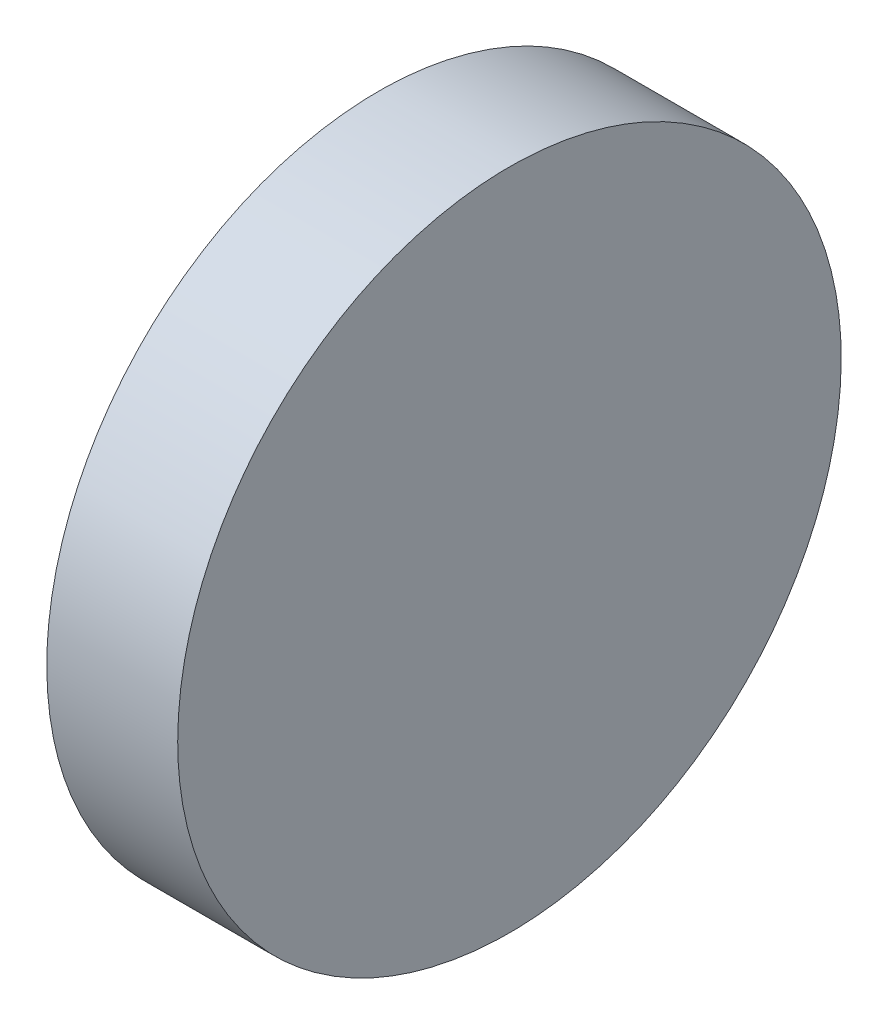
ISO-10303-21;
HEADER;
FILE_DESCRIPTION(('STEP AP214'),'2;1');
FILE_NAME('part.step','',(''),(''),'','','');
FILE_SCHEMA(('AUTOMOTIVE_DESIGN { 1 0 10303 214 1 1 1 1 }'));
ENDSEC;
DATA;
#1=APPLICATION_CONTEXT('core data for automotive mechanical design processes');
#2=APPLICATION_PROTOCOL_DEFINITION('international standard','automotive_design',2000,#1);
#3=PRODUCT_CONTEXT('',#1,'mechanical');
#4=PRODUCT('Part','Part','',(#3));
#5=PRODUCT_RELATED_PRODUCT_CATEGORY('part','',(#4));
#6=PRODUCT_DEFINITION_FORMATION('','',#4);
#7=PRODUCT_DEFINITION_CONTEXT('part definition',#1,'design');
#8=PRODUCT_DEFINITION('design','',#6,#7);
#9=PRODUCT_DEFINITION_SHAPE('','',#8);
#10=(LENGTH_UNIT() NAMED_UNIT(*) SI_UNIT(.MILLI.,.METRE.));
#11=(NAMED_UNIT(*) PLANE_ANGLE_UNIT() SI_UNIT($,.RADIAN.));
#12=(NAMED_UNIT(*) SI_UNIT($,.STERADIAN.) SOLID_ANGLE_UNIT());
#13=UNCERTAINTY_MEASURE_WITH_UNIT(LENGTH_MEASURE(1.E-05),#10,'distance_accuracy_value','');
#14=(GEOMETRIC_REPRESENTATION_CONTEXT(3) GLOBAL_UNCERTAINTY_ASSIGNED_CONTEXT((#13)) GLOBAL_UNIT_ASSIGNED_CONTEXT((#10,
#11,#12)) REPRESENTATION_CONTEXT('',''));
#15=CARTESIAN_POINT('',(0.,0.,0.));
#16=DIRECTION('',(0.,0.,1.));
#17=DIRECTION('',(1.,0.,0.));
#18=AXIS2_PLACEMENT_3D('',#15,#16,#17);
#19=CARTESIAN_POINT('',(25.7111386377281,12.7,13.7994974746831));
#20=CARTESIAN_POINT('',(25.7111386377281,12.9355219708907,13.7994974746831));
#21=CARTESIAN_POINT('',(25.7111386377281,13.4065659126721,13.7058010090835));
#22=CARTESIAN_POINT('',(25.7111386377281,14.0055635701758,13.3055635701758));
#23=CARTESIAN_POINT('',(25.7111386377281,14.4058010090835,12.7065659126721));
#24=CARTESIAN_POINT('',(25.7111386377281,14.5463457074828,12.));
#25=CARTESIAN_POINT('',(25.7111386377281,14.4058010090835,11.2934340873279));
#26=CARTESIAN_POINT('',(25.7111386377281,14.0055635701758,10.6944364298242));
#27=CARTESIAN_POINT('',(25.7111386377281,13.4065659126721,10.2941989909165));
#28=CARTESIAN_POINT('',(25.7111386377281,12.7,10.1536542925171));
#29=CARTESIAN_POINT('',(25.7111386377281,11.9934340873279,10.2941989909165));
#30=CARTESIAN_POINT('',(25.7111386377281,11.3944364298242,10.6944364298242));
#31=CARTESIAN_POINT('',(25.7111386377281,10.9941989909165,11.2934340873279));
#32=CARTESIAN_POINT('',(25.7111386377281,10.8536542925172,12.));
#33=CARTESIAN_POINT('',(25.7111386377281,10.9941989909165,12.7065659126721));
#34=CARTESIAN_POINT('',(25.7111386377281,11.3944364298242,13.3055635701758));
#35=CARTESIAN_POINT('',(25.7111386377281,11.9934340873279,13.7058010090835));
#36=CARTESIAN_POINT('',(25.7111386377281,12.4644780291093,13.7994974746831));
#37=CARTESIAN_POINT('',(25.7111386377281,12.7,13.7994974746831));
#38=B_SPLINE_CURVE_WITH_KNOTS('',3,(#19,#20,#21,#22,#23,#24,#25,#26,#27,#28,#29,#30,#31,#32,#33,
#34,#35,#36,#37),.UNSPECIFIED.,.T.,.F.,(4,1,1,1,1,1,1,1,1,1,1,1,1,1,1,1,4),(0.,
0.0624999999999998,0.125,0.1875,0.25,0.3125,0.375,0.4375,0.5,0.5625,0.625,0.6875,0.75,0.8125,
0.875,0.9375,1.),.UNSPECIFIED.);
#39=DIRECTION('',(-1.,0.,0.));
#40=VECTOR('',#39,1.);
#41=SURFACE_OF_LINEAR_EXTRUSION('',#38,#40);
#42=CARTESIAN_POINT('',(25.7111386377281,12.7,13.7994974746831));
#43=CARTESIAN_POINT('',(25.7111386377281,12.9355219708907,13.7994974746831));
#44=CARTESIAN_POINT('',(25.7111386377281,13.4065659126721,13.7058010090835));
#45=CARTESIAN_POINT('',(25.7111386377281,14.0055635701758,13.3055635701758));
#46=CARTESIAN_POINT('',(25.7111386377281,14.4058010090835,12.7065659126721));
#47=CARTESIAN_POINT('',(25.7111386377281,14.5463457074828,12.));
#48=CARTESIAN_POINT('',(25.7111386377281,14.4058010090835,11.2934340873279));
#49=CARTESIAN_POINT('',(25.7111386377281,14.0055635701758,10.6944364298242));
#50=CARTESIAN_POINT('',(25.7111386377281,13.4065659126721,10.2941989909165));
#51=CARTESIAN_POINT('',(25.7111386377281,12.7,10.1536542925171));
#52=CARTESIAN_POINT('',(25.7111386377281,11.9934340873279,10.2941989909165));
#53=CARTESIAN_POINT('',(25.7111386377281,11.3944364298242,10.6944364298242));
#54=CARTESIAN_POINT('',(25.7111386377281,10.9941989909165,11.2934340873279));
#55=CARTESIAN_POINT('',(25.7111386377281,10.8536542925172,12.));
#56=CARTESIAN_POINT('',(25.7111386377281,10.9941989909165,12.7065659126721));
#57=CARTESIAN_POINT('',(25.7111386377281,11.3944364298242,13.3055635701758));
#58=CARTESIAN_POINT('',(25.7111386377281,11.9934340873279,13.7058010090835));
#59=CARTESIAN_POINT('',(25.7111386377281,12.4644780291093,13.7994974746831));
#60=CARTESIAN_POINT('',(25.7111386377281,12.7,13.7994974746831));
#61=B_SPLINE_CURVE_WITH_KNOTS('',3,(#42,#43,#44,#45,#46,#47,#48,#49,#50,#51,#52,#53,#54,#55,#56,
#57,#58,#59,#60),.UNSPECIFIED.,.T.,.F.,(4,1,1,1,1,1,1,1,1,1,1,1,1,1,1,1,4),(0.,
0.0624999999999998,0.125,0.1875,0.25,0.3125,0.375,0.4375,0.5,0.5625,0.625,0.6875,0.75,0.8125,
0.875,0.9375,1.),.UNSPECIFIED.);
#62=CARTESIAN_POINT('',(25.7111386377281,12.7,13.7994974746831));
#63=VERTEX_POINT('',#62);
#64=EDGE_CURVE('E9',#63,#63,#61,.T.);
#65=ORIENTED_EDGE('',*,*,#64,.T.);
#66=EDGE_LOOP('',(#65));
#67=FACE_BOUND('',#66,.T.);
#68=CARTESIAN_POINT('',(25.001,12.7,13.7994974746831));
#69=CARTESIAN_POINT('',(25.001,12.6705590589749,13.799497495997));
#70=CARTESIAN_POINT('',(25.001,12.6411187290328,13.7987654390511));
#71=CARTESIAN_POINT('',(25.001,12.582308094268,13.7958513328847));
#72=CARTESIAN_POINT('',(25.001,12.552937793667,13.7936691983595));
#73=CARTESIAN_POINT('',(25.001,12.4943374905285,13.787868905595));
#74=CARTESIAN_POINT('',(25.001,12.465107497758,13.7842506488118));
#75=CARTESIAN_POINT('',(25.001,12.406857659743,13.7755920304944));
#76=CARTESIAN_POINT('',(25.001,12.3778378236172,13.7705516076267));
#77=CARTESIAN_POINT('',(25.001,12.3200782743428,13.7590625198852));
#78=CARTESIAN_POINT('',(25.001,12.2913385611941,13.7526138550115));
#79=CARTESIAN_POINT('',(25.001,12.2342092070471,13.7383221212957));
#80=CARTESIAN_POINT('',(25.001,12.2058195510031,13.7304791126085));
#81=CARTESIAN_POINT('',(25.001,12.1494602997703,13.7134125414676));
#82=CARTESIAN_POINT('',(25.001,12.1214906758886,13.7041890737916));
#83=CARTESIAN_POINT('',(25.001,12.0660413837378,13.684375418347));
#84=CARTESIAN_POINT('',(25.001,12.0385616867419,13.6737853110137));
#85=CARTESIAN_POINT('',(25.001,11.9841625729701,13.6512524603172));
#86=CARTESIAN_POINT('',(25.001,11.9572431561942,13.6393097169541));
#87=CARTESIAN_POINT('',(25.001,11.904024215536,13.6141115165345));
#88=CARTESIAN_POINT('',(25.001,11.8777247282169,13.6008559822887));
#89=CARTESIAN_POINT('',(25.001,11.8258048314745,13.5730718619406));
#90=CARTESIAN_POINT('',(25.001,11.8001844687801,13.5585431885315));
#91=CARTESIAN_POINT('',(25.001,11.7496821325853,13.5282524159037));
#92=CARTESIAN_POINT('',(25.001,11.7248001909819,13.5124902635102));
#93=CARTESIAN_POINT('',(25.001,11.6758340125771,13.4797721091197));
#94=CARTESIAN_POINT('',(25.001,11.6517497757758,13.4628161071226));
#95=CARTESIAN_POINT('',(25.001,11.6044383435635,13.4277498092061));
#96=CARTESIAN_POINT('',(25.001,11.5812111112317,13.4096395631047));
#97=CARTESIAN_POINT('',(25.001,11.5356730468204,13.3723043557156));
#98=CARTESIAN_POINT('',(25.001,11.513362151962,13.3530794710107));
#99=CARTESIAN_POINT('',(25.001,11.4697160434587,13.3135545148159));
#100=CARTESIAN_POINT('',(25.001,11.4483807724922,13.2932545066451));
#101=CARTESIAN_POINT('',(25.001,11.4067454933549,13.2516192275078));
#102=CARTESIAN_POINT('',(25.001,11.3864454851841,13.2302839565413));
#103=CARTESIAN_POINT('',(25.001,11.3469205289893,13.186637848038));
#104=CARTESIAN_POINT('',(25.001,11.3276956442844,13.1643269531796));
#105=CARTESIAN_POINT('',(25.001,11.2903604368953,13.1187888887683));
#106=CARTESIAN_POINT('',(25.001,11.2722501907939,13.0955616564365));
#107=CARTESIAN_POINT('',(25.001,11.2371838928774,13.0482502242242));
#108=CARTESIAN_POINT('',(25.001,11.2202278908803,13.0241659874228));
#109=CARTESIAN_POINT('',(25.001,11.1875097364898,12.9751998090182));
#110=CARTESIAN_POINT('',(25.001,11.1717475840963,12.9503178674149));
#111=CARTESIAN_POINT('',(25.001,11.1414568114685,12.8998155312197));
#112=CARTESIAN_POINT('',(25.001,11.1269281380594,12.8741951685248));
#113=CARTESIAN_POINT('',(25.001,11.0991440177113,12.8222752717838));
#114=CARTESIAN_POINT('',(25.001,11.0858884834653,12.7959757844665));
#115=CARTESIAN_POINT('',(25.001,11.060690283046,12.7427568438033));
#116=CARTESIAN_POINT('',(25.001,11.0487475396834,12.7158374270206));
#117=CARTESIAN_POINT('',(25.001,11.0262146889858,12.6614383132675));
#118=CARTESIAN_POINT('',(25.001,11.0156245816508,12.6339586162971));
#119=CARTESIAN_POINT('',(25.001,10.9958109262105,12.5785093240764));
#120=CARTESIAN_POINT('',(25.001,10.9865874585403,12.5505397000991));
#121=CARTESIAN_POINT('',(25.001,10.9695208873836,12.4941804491275));
#122=CARTESIAN_POINT('',(25.001,10.9616778786748,12.4657907934403));
#123=CARTESIAN_POINT('',(25.001,10.947386145018,12.4086614383185));
#124=CARTESIAN_POINT('',(25.001,10.9409374802247,12.3799217238381));
#125=CARTESIAN_POINT('',(25.001,10.9294483922634,12.3221621782019));
#126=CARTESIAN_POINT('',(25.001,10.9244079690954,12.2931423470461));
#127=CARTESIAN_POINT('',(25.001,10.9157493515983,12.2348924954532));
#128=CARTESIAN_POINT('',(25.001,10.9121310959356,12.205662484136));
#129=CARTESIAN_POINT('',(25.001,10.9063308001101,12.1470622316667));
#130=CARTESIAN_POINT('',(25.001,10.9041486614037,12.1176920002757));
#131=CARTESIAN_POINT('',(25.001,10.9012345666601,12.0588811764291));
#132=CARTESIAN_POINT('',(25.001,10.9005025253169,12.0294405882146));
#133=CARTESIAN_POINT('',(25.001,10.9005025253169,11.9705594117854));
#134=CARTESIAN_POINT('',(25.001,10.9012345666601,11.9411188235709));
#135=CARTESIAN_POINT('',(25.001,10.9041486614037,11.8823079997243));
#136=CARTESIAN_POINT('',(25.001,10.9063308001101,11.8529377683333));
#137=CARTESIAN_POINT('',(25.001,10.9121310959356,11.794337515864));
#138=CARTESIAN_POINT('',(25.001,10.9157493515983,11.7651075045468));
#139=CARTESIAN_POINT('',(25.001,10.9244079690954,11.7068576529539));
#140=CARTESIAN_POINT('',(25.001,10.9294483922634,11.6778378217981));
#141=CARTESIAN_POINT('',(25.001,10.9409374802247,11.6200782761619));
#142=CARTESIAN_POINT('',(25.001,10.947386145018,11.5913385616815));
#143=CARTESIAN_POINT('',(25.001,10.9616778786748,11.5342092065597));
#144=CARTESIAN_POINT('',(25.001,10.9695208873836,11.5058195508725));
#145=CARTESIAN_POINT('',(25.001,10.9865874585403,11.4494602999009));
#146=CARTESIAN_POINT('',(25.001,10.9958109262105,11.4214906759236));
#147=CARTESIAN_POINT('',(25.001,11.0156245816508,11.3660413837029));
#148=CARTESIAN_POINT('',(25.001,11.0262146889858,11.3385616867325));
#149=CARTESIAN_POINT('',(25.001,11.0487475396834,11.2841625729794));
#150=CARTESIAN_POINT('',(25.001,11.060690283046,11.2572431561967));
#151=CARTESIAN_POINT('',(25.001,11.0858884834653,11.2040242155335));
#152=CARTESIAN_POINT('',(25.001,11.0991440177113,11.1777247282162));
#153=CARTESIAN_POINT('',(25.001,11.1269281380594,11.1258048314752));
#154=CARTESIAN_POINT('',(25.001,11.1414568114685,11.1001844687803));
#155=CARTESIAN_POINT('',(25.001,11.1717475840963,11.0496821325851));
#156=CARTESIAN_POINT('',(25.001,11.1875097364898,11.0248001909818));
#157=CARTESIAN_POINT('',(25.001,11.2202278908803,10.9758340125772));
#158=CARTESIAN_POINT('',(25.001,11.2371838928773,10.9517497757758));
#159=CARTESIAN_POINT('',(25.001,11.2722501907939,10.9044383435635));
#160=CARTESIAN_POINT('',(25.001,11.2903604368953,10.8812111112317));
#161=CARTESIAN_POINT('',(25.001,11.3276956442844,10.8356730468204));
#162=CARTESIAN_POINT('',(25.001,11.3469205289893,10.813362151962));
#163=CARTESIAN_POINT('',(25.001,11.3864454851841,10.7697160434587));
#164=CARTESIAN_POINT('',(25.001,11.4067454933549,10.7483807724922));
#165=CARTESIAN_POINT('',(25.001,11.4483807724922,10.7067454933549));
#166=CARTESIAN_POINT('',(25.001,11.4697160434587,10.6864454851841));
#167=CARTESIAN_POINT('',(25.001,11.513362151962,10.6469205289893));
#168=CARTESIAN_POINT('',(25.001,11.5356730468204,10.6276956442844));
#169=CARTESIAN_POINT('',(25.001,11.5812111112317,10.5903604368953));
#170=CARTESIAN_POINT('',(25.001,11.6044383435635,10.5722501907939));
#171=CARTESIAN_POINT('',(25.001,11.6517497757758,10.5371838928774));
#172=CARTESIAN_POINT('',(25.001,11.6758340125772,10.5202278908803));
#173=CARTESIAN_POINT('',(25.001,11.7248001909818,10.4875097364898));
#174=CARTESIAN_POINT('',(25.001,11.7496821325851,10.4717475840963));
#175=CARTESIAN_POINT('',(25.001,11.8001844687803,10.4414568114685));
#176=CARTESIAN_POINT('',(25.001,11.8258048314752,10.4269281380594));
#177=CARTESIAN_POINT('',(25.001,11.8777247282162,10.3991440177113));
#178=CARTESIAN_POINT('',(25.001,11.9040242155335,10.3858884834653));
#179=CARTESIAN_POINT('',(25.001,11.9572431561967,10.360690283046));
#180=CARTESIAN_POINT('',(25.001,11.9841625729794,10.3487475396834));
#181=CARTESIAN_POINT('',(25.001,12.0385616867325,10.3262146889858));
#182=CARTESIAN_POINT('',(25.001,12.0660413837029,10.3156245816508));
#183=CARTESIAN_POINT('',(25.001,12.1214906759236,10.2958109262105));
#184=CARTESIAN_POINT('',(25.001,12.1494602999009,10.2865874585403));
#185=CARTESIAN_POINT('',(25.001,12.2058195508725,10.2695208873836));
#186=CARTESIAN_POINT('',(25.001,12.2342092065597,10.2616778786748));
#187=CARTESIAN_POINT('',(25.001,12.2913385616815,10.247386145018));
#188=CARTESIAN_POINT('',(25.001,12.3200782761619,10.2409374802247));
#189=CARTESIAN_POINT('',(25.001,12.3778378217981,10.2294483922634));
#190=CARTESIAN_POINT('',(25.001,12.4068576529539,10.2244079690954));
#191=CARTESIAN_POINT('',(25.001,12.4651075045468,10.2157493515983));
#192=CARTESIAN_POINT('',(25.001,12.494337515864,10.2121310959356));
#193=CARTESIAN_POINT('',(25.001,12.5529377683333,10.2063308001101));
#194=CARTESIAN_POINT('',(25.001,12.5823079997243,10.2041486614037));
#195=CARTESIAN_POINT('',(25.001,12.6411188235709,10.2012345666601));
#196=CARTESIAN_POINT('',(25.001,12.6705594117854,10.2005025253169));
#197=CARTESIAN_POINT('',(25.001,12.7294405882146,10.2005025253169));
#198=CARTESIAN_POINT('',(25.001,12.7588811764291,10.2012345666601));
#199=CARTESIAN_POINT('',(25.001,12.8176920002757,10.2041486614037));
#200=CARTESIAN_POINT('',(25.001,12.8470622316667,10.2063308001101));
#201=CARTESIAN_POINT('',(25.001,12.905662484136,10.2121310959356));
#202=CARTESIAN_POINT('',(25.001,12.9348924954532,10.2157493515983));
#203=CARTESIAN_POINT('',(25.001,12.9931423470461,10.2244079690954));
#204=CARTESIAN_POINT('',(25.001,13.0221621782019,10.2294483922634));
#205=CARTESIAN_POINT('',(25.001,13.0799217238381,10.2409374802247));
#206=CARTESIAN_POINT('',(25.001,13.1086614383184,10.247386145018));
#207=CARTESIAN_POINT('',(25.001,13.1657907934403,10.2616778786748));
#208=CARTESIAN_POINT('',(25.001,13.1941804491275,10.2695208873836));
#209=CARTESIAN_POINT('',(25.001,13.2505397000991,10.2865874585403));
#210=CARTESIAN_POINT('',(25.001,13.2785093240764,10.2958109262105));
#211=CARTESIAN_POINT('',(25.001,13.3339586162971,10.3156245816508));
#212=CARTESIAN_POINT('',(25.001,13.3614383132675,10.3262146889858));
#213=CARTESIAN_POINT('',(25.001,13.4158374270206,10.3487475396834));
#214=CARTESIAN_POINT('',(25.001,13.4427568438033,10.360690283046));
#215=CARTESIAN_POINT('',(25.001,13.4959757844665,10.3858884834653));
#216=CARTESIAN_POINT('',(25.001,13.5222752717838,10.3991440177113));
#217=CARTESIAN_POINT('',(25.001,13.5741951685248,10.4269281380594));
#218=CARTESIAN_POINT('',(25.001,13.5998155312197,10.4414568114685));
#219=CARTESIAN_POINT('',(25.001,13.6503178674149,10.4717475840963));
#220=CARTESIAN_POINT('',(25.001,13.6751998090182,10.4875097364898));
#221=CARTESIAN_POINT('',(25.001,13.7241659874228,10.5202278908803));
#222=CARTESIAN_POINT('',(25.001,13.7482502242242,10.5371838928774));
#223=CARTESIAN_POINT('',(25.001,13.7955616564365,10.5722501907939));
#224=CARTESIAN_POINT('',(25.001,13.8187888887683,10.5903604368953));
#225=CARTESIAN_POINT('',(25.001,13.8643269531796,10.6276956442844));
#226=CARTESIAN_POINT('',(25.001,13.886637848038,10.6469205289893));
#227=CARTESIAN_POINT('',(25.001,13.9302839565413,10.6864454851841));
#228=CARTESIAN_POINT('',(25.001,13.9516192275078,10.7067454933549));
#229=CARTESIAN_POINT('',(25.001,13.9932545066451,10.7483807724922));
#230=CARTESIAN_POINT('',(25.001,14.0135545148159,10.7697160434587));
#231=CARTESIAN_POINT('',(25.001,14.0530794710107,10.813362151962));
#232=CARTESIAN_POINT('',(25.001,14.0723043557156,10.8356730468204));
#233=CARTESIAN_POINT('',(25.001,14.1096395631047,10.8812111112317));
#234=CARTESIAN_POINT('',(25.001,14.1277498092061,10.9044383435635));
#235=CARTESIAN_POINT('',(25.001,14.1628161071226,10.9517497757758));
#236=CARTESIAN_POINT('',(25.001,14.1797721091197,10.9758340125772));
#237=CARTESIAN_POINT('',(25.001,14.2124902635102,11.0248001909818));
#238=CARTESIAN_POINT('',(25.001,14.2282524159037,11.0496821325851));
#239=CARTESIAN_POINT('',(25.001,14.2585431885315,11.1001844687803));
#240=CARTESIAN_POINT('',(25.001,14.2730718619406,11.1258048314752));
#241=CARTESIAN_POINT('',(25.001,14.3008559822887,11.1777247282162));
#242=CARTESIAN_POINT('',(25.001,14.3141115165347,11.2040242155335));
#243=CARTESIAN_POINT('',(25.001,14.339309716954,11.2572431561967));
#244=CARTESIAN_POINT('',(25.001,14.3512524603166,11.2841625729794));
#245=CARTESIAN_POINT('',(25.001,14.3737853110142,11.3385616867325));
#246=CARTESIAN_POINT('',(25.001,14.3843754183492,11.3660413837029));
#247=CARTESIAN_POINT('',(25.001,14.4041890737895,11.4214906759236));
#248=CARTESIAN_POINT('',(25.001,14.4134125414597,11.4494602999009));
#249=CARTESIAN_POINT('',(25.001,14.4304791126164,11.5058195508725));
#250=CARTESIAN_POINT('',(25.001,14.4383221213252,11.5342092065597));
#251=CARTESIAN_POINT('',(25.001,14.452613854982,11.5913385616815));
#252=CARTESIAN_POINT('',(25.001,14.4590625197753,11.6200782761619));
#253=CARTESIAN_POINT('',(25.001,14.4705516077366,11.6778378217981));
#254=CARTESIAN_POINT('',(25.001,14.4755920309046,11.7068576529539));
#255=CARTESIAN_POINT('',(25.001,14.4842506484017,11.7651075045468));
#256=CARTESIAN_POINT('',(25.001,14.4878689040644,11.794337515864));
#257=CARTESIAN_POINT('',(25.001,14.4936691998899,11.8529377683333));
#258=CARTESIAN_POINT('',(25.001,14.4958513385963,11.8823079997243));
#259=CARTESIAN_POINT('',(25.001,14.4987654333399,11.9411188235709));
#260=CARTESIAN_POINT('',(25.001,14.4994974746831,11.9705594117854));
#261=CARTESIAN_POINT('',(25.001,14.4994974746831,12.0294405882146));
#262=CARTESIAN_POINT('',(25.001,14.4987654333399,12.0588811764291));
#263=CARTESIAN_POINT('',(25.001,14.4958513385963,12.1176920002757));
#264=CARTESIAN_POINT('',(25.001,14.4936691998899,12.1470622316667));
#265=CARTESIAN_POINT('',(25.001,14.4878689040644,12.205662484136));
#266=CARTESIAN_POINT('',(25.001,14.4842506484017,12.2348924954532));
#267=CARTESIAN_POINT('',(25.001,14.4755920309046,12.2931423470461));
#268=CARTESIAN_POINT('',(25.001,14.4705516077366,12.3221621782019));
#269=CARTESIAN_POINT('',(25.001,14.4590625197753,12.3799217238381));
#270=CARTESIAN_POINT('',(25.001,14.452613854982,12.4086614383184));
#271=CARTESIAN_POINT('',(25.001,14.4383221213252,12.4657907934403));
#272=CARTESIAN_POINT('',(25.001,14.4304791126164,12.4941804491275));
#273=CARTESIAN_POINT('',(25.001,14.4134125414597,12.5505397000991));
#274=CARTESIAN_POINT('',(25.001,14.4041890737895,12.5785093240764));
#275=CARTESIAN_POINT('',(25.001,14.3843754183491,12.6339586162971));
#276=CARTESIAN_POINT('',(25.001,14.3737853110142,12.6614383132675));
#277=CARTESIAN_POINT('',(25.001,14.3512524603166,12.7158374270205));
#278=CARTESIAN_POINT('',(25.001,14.339309716954,12.7427568438033));
#279=CARTESIAN_POINT('',(25.001,14.3141115165347,12.7959757844665));
#280=CARTESIAN_POINT('',(25.001,14.3008559822887,12.8222752717838));
#281=CARTESIAN_POINT('',(25.001,14.2730718619406,12.8741951685248));
#282=CARTESIAN_POINT('',(25.001,14.2585431885315,12.8998155312197));
#283=CARTESIAN_POINT('',(25.001,14.2282524159037,12.9503178674149));
#284=CARTESIAN_POINT('',(25.001,14.2124902635102,12.9751998090182));
#285=CARTESIAN_POINT('',(25.001,14.1797721091197,13.0241659874228));
#286=CARTESIAN_POINT('',(25.001,14.1628161071226,13.0482502242242));
#287=CARTESIAN_POINT('',(25.001,14.1277498092061,13.0955616564365));
#288=CARTESIAN_POINT('',(25.001,14.1096395631047,13.1187888887683));
#289=CARTESIAN_POINT('',(25.001,14.0723043557156,13.1643269531796));
#290=CARTESIAN_POINT('',(25.001,14.0530794710107,13.186637848038));
#291=CARTESIAN_POINT('',(25.001,14.0135545148159,13.2302839565413));
#292=CARTESIAN_POINT('',(25.001,13.9932545066451,13.2516192275078));
#293=CARTESIAN_POINT('',(25.001,13.9516192275078,13.2932545066451));
#294=CARTESIAN_POINT('',(25.001,13.9302839565413,13.3135545148159));
#295=CARTESIAN_POINT('',(25.001,13.886637848038,13.3530794710107));
#296=CARTESIAN_POINT('',(25.001,13.8643269531796,13.3723043557156));
#297=CARTESIAN_POINT('',(25.001,13.8187888887683,13.4096395631047));
#298=CARTESIAN_POINT('',(25.001,13.7955616564365,13.4277498092061));
#299=CARTESIAN_POINT('',(25.001,13.7482502242242,13.4628161071227));
#300=CARTESIAN_POINT('',(25.001,13.7241659874229,13.4797721091197));
#301=CARTESIAN_POINT('',(25.001,13.6751998090181,13.5124902635102));
#302=CARTESIAN_POINT('',(25.001,13.6503178674147,13.5282524159037));
#303=CARTESIAN_POINT('',(25.001,13.5998155312199,13.5585431885315));
#304=CARTESIAN_POINT('',(25.001,13.5741951685255,13.5730718619406));
#305=CARTESIAN_POINT('',(25.001,13.5222752717831,13.6008559822887));
#306=CARTESIAN_POINT('',(25.001,13.495975784464,13.6141115165345));
#307=CARTESIAN_POINT('',(25.001,13.4427568438058,13.6393097169541));
#308=CARTESIAN_POINT('',(25.001,13.4158374270299,13.6512524603172));
#309=CARTESIAN_POINT('',(25.001,13.3614383132581,13.6737853110137));
#310=CARTESIAN_POINT('',(25.001,13.3339586162622,13.684375418347));
#311=CARTESIAN_POINT('',(25.001,13.2785093241114,13.7041890737916));
#312=CARTESIAN_POINT('',(25.001,13.2505397002297,13.7134125414676));
#313=CARTESIAN_POINT('',(25.001,13.1941804489969,13.7304791126085));
#314=CARTESIAN_POINT('',(25.001,13.1657907929529,13.7383221212957));
#315=CARTESIAN_POINT('',(25.001,13.1086614388059,13.7526138550115));
#316=CARTESIAN_POINT('',(25.001,13.0799217256572,13.7590625198852));
#317=CARTESIAN_POINT('',(25.001,13.0221621763828,13.7705516076267));
#318=CARTESIAN_POINT('',(25.001,12.993142340257,13.7755920304944));
#319=CARTESIAN_POINT('',(25.001,12.934892502242,13.7842506488118));
#320=CARTESIAN_POINT('',(25.001,12.9056625094715,13.787868905595));
#321=CARTESIAN_POINT('',(25.001,12.847062206333,13.7936691983595));
#322=CARTESIAN_POINT('',(25.001,12.817691905732,13.7958513328847));
#323=CARTESIAN_POINT('',(25.001,12.7588812709672,13.7987654390511));
#324=CARTESIAN_POINT('',(25.001,12.7294409410251,13.799497495997));
#325=CARTESIAN_POINT('',(25.001,12.7,13.7994974746831));
#326=B_SPLINE_CURVE_WITH_KNOTS('',3,(#68,#69,#70,#71,#72,#73,#74,#75,#76,#77,#78,#79,#80,#81,
#82,#83,#84,#85,#86,#87,#88,#89,#90,#91,#92,#93,#94,#95,#96,#97,#98,#99,#100,#101,#102,#103,
#104,#105,#106,#107,#108,#109,#110,#111,#112,#113,#114,#115,#116,#117,#118,#119,#120,#121,#122,
#123,#124,#125,#126,#127,#128,#129,#130,#131,#132,#133,#134,#135,#136,#137,#138,#139,#140,#141,
#142,#143,#144,#145,#146,#147,#148,#149,#150,#151,#152,#153,#154,#155,#156,#157,#158,#159,#160,
#161,#162,#163,#164,#165,#166,#167,#168,#169,#170,#171,#172,#173,#174,#175,#176,#177,#178,#179,
#180,#181,#182,#183,#184,#185,#186,#187,#188,#189,#190,#191,#192,#193,#194,#195,#196,#197,#198,
#199,#200,#201,#202,#203,#204,#205,#206,#207,#208,#209,#210,#211,#212,#213,#214,#215,#216,#217,
#218,#219,#220,#221,#222,#223,#224,#225,#226,#227,#228,#229,#230,#231,#232,#233,#234,#235,#236,
#237,#238,#239,#240,#241,#242,#243,#244,#245,#246,#247,#248,#249,#250,#251,#252,#253,#254,#255,
#256,#257,#258,#259,#260,#261,#262,#263,#264,#265,#266,#267,#268,#269,#270,#271,#272,#273,#274,
#275,#276,#277,#278,#279,#280,#281,#282,#283,#284,#285,#286,#287,#288,#289,#290,#291,#292,#293,
#294,#295,#296,#297,#298,#299,#300,#301,#302,#303,#304,#305,#306,#307,#308,#309,#310,#311,#312,
#313,#314,#315,#316,#317,#318,#319,#320,#321,#322,#323,#324,#325),.UNSPECIFIED.,.F.,.F.,(4,2,2,
2,2,2,2,2,2,2,2,2,2,2,2,2,2,2,2,2,2,2,2,2,2,2,2,2,2,2,2,2,2,2,2,2,2,2,2,2,2,2,2,2,2,2,2,2,2,2,2,
2,2,2,2,2,2,2,2,2,2,2,2,2,2,2,2,2,2,2,2,2,2,2,2,2,2,2,2,2,2,2,2,2,2,2,2,2,2,2,2,2,2,2,2,2,2,2,2,
2,2,2,2,2,2,2,2,2,2,2,2,2,2,2,2,2,2,2,2,2,2,2,2,2,2,2,2,2,4),(0.,0.0883128579187113,
0.176630911533427,0.26495502640719,0.353282951002318,0.441610875597449,0.52993499047121,
0.618253044085926,0.706565902004634,0.794878759923346,0.88319681353806,0.971520928411823,
1.05984885300695,1.14817677760208,1.23650089247584,1.32481894609056,1.41313180400927,
1.50144466192798,1.58976271554269,1.67808683041645,1.76641475501158,1.85474267960671,
1.94306679448048,2.03138484809519,2.1196977060139,2.20801056393261,2.29632861754733,
2.38465273242109,2.47298065701621,2.56130858161134,2.64963269648511,2.73795075009982,
2.82626360801853,2.91457646593724,3.00289451955196,3.09121863442572,3.17954655902085,
3.26787448361598,3.35619859848974,3.44451665210446,3.53282951002317,3.62114236794188,
3.70946042155659,3.79778453643035,3.88611246102548,3.97444038562061,4.06276450049437,
4.15108255410909,4.2393954120278,4.32770826994651,4.41602632356122,4.50435043843499,
4.59267836303012,4.68100628762525,4.76933040249901,4.85764845611372,4.94596131403243,
5.03427417195114,5.12259222556586,5.21091634043962,5.29924426503475,5.38757218962987,
5.47589630450364,5.56421435811835,5.65252721603706,5.74084007395577,5.82915812757049,
5.91748224244425,6.00581016703938,6.09413809163451,6.18246220650827,6.27078026012299,
6.3590931180417,6.44740597596041,6.53572402957512,6.62404814444889,6.71237606904401,
6.80070399363914,6.88902810851291,6.97734616212762,7.06565902004633,7.15397187796504,
7.24228993157976,7.33061404645352,7.41894197104865,7.50726989564378,7.59559401051754,
7.68391206413226,7.77222492205097,7.86053777996968,7.9488558335844,8.03717994845816,
8.12550787305329,8.21383579764841,8.30215991252217,8.39047796613689,8.4787908240556,
8.56710368197431,8.65542173558902,8.74374585046278,8.83207377505791,8.92040169965304,
9.00872581452681,9.09704386814152,9.18535672606023,9.27366958397894,9.36198763759365,
9.45031175246742,9.53863967706255,9.62696760165768,9.71529171653144,9.80360977014615,
9.89192262806487,9.98023548598357,10.0685535395983,10.1568776544721,10.2452055790672,
10.3335335036623,10.4218576185361,10.5101756721508,10.5984885300695,10.6868013879882,
10.7751194416029,10.8634435564767,10.9517714810718,11.0400994056669,11.1284235205407,
11.2167415741554,11.3050544320741),.UNSPECIFIED.);
#327=CARTESIAN_POINT('',(25.001,12.7,13.7994974746831));
#328=VERTEX_POINT('',#327);
#329=EDGE_CURVE('E24',#328,#328,#326,.F.);
#330=ORIENTED_EDGE('',*,*,#329,.F.);
#331=EDGE_LOOP('',(#330));
#332=FACE_BOUND('',#331,.T.);
#333=ADVANCED_FACE('F14',(#67,#332),#41,.T.);
#334=CARTESIAN_POINT('',(25.7111386377281,39.,0.));
#335=DIRECTION('',(-1.,0.,0.));
#336=DIRECTION('',(0.,-1.,0.));
#337=AXIS2_PLACEMENT_3D('',#334,#335,#336);
#338=PLANE('',#337);
#339=ORIENTED_EDGE('',*,*,#64,.F.);
#340=EDGE_LOOP('',(#339));
#341=FACE_BOUND('',#340,.T.);
#342=ADVANCED_FACE('F62',(#341),#338,.F.);
#343=CARTESIAN_POINT('',(25.001,39.,0.));
#344=DIRECTION('',(-1.,0.,0.));
#345=DIRECTION('',(0.,-1.,0.));
#346=AXIS2_PLACEMENT_3D('',#343,#344,#345);
#347=PLANE('',#346);
#348=ORIENTED_EDGE('',*,*,#329,.T.);
#349=EDGE_LOOP('',(#348));
#350=FACE_BOUND('',#349,.T.);
#351=ADVANCED_FACE('F31',(#350),#347,.T.);
#352=CLOSED_SHELL('',(#333,#342,#351));
#353=MANIFOLD_SOLID_BREP('B1',#352);
#354=ADVANCED_BREP_SHAPE_REPRESENTATION('',(#18,#353),#14);
#355=SHAPE_DEFINITION_REPRESENTATION(#9,#354);
ENDSEC;
END-ISO-10303-21;
